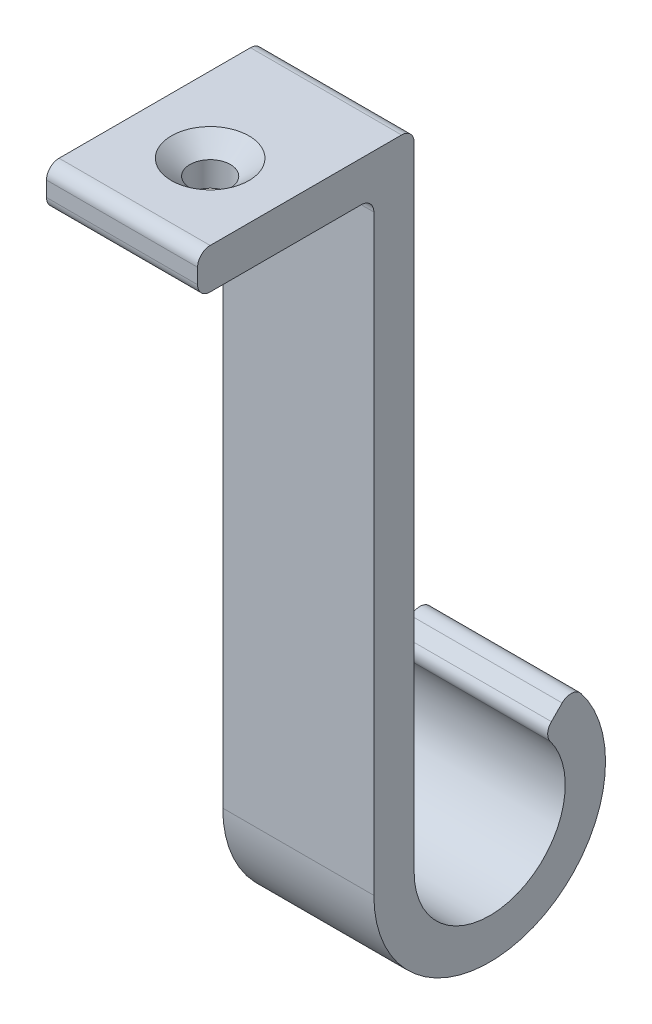
ISO-10303-21;
HEADER;
FILE_DESCRIPTION(('STEP AP214'),'2;1');
FILE_NAME('part.step','',(''),(''),'','','');
FILE_SCHEMA(('AUTOMOTIVE_DESIGN { 1 0 10303 214 1 1 1 1 }'));
ENDSEC;
DATA;
#1=APPLICATION_CONTEXT('core data for automotive mechanical design processes');
#2=APPLICATION_PROTOCOL_DEFINITION('international standard','automotive_design',2000,#1);
#3=PRODUCT_CONTEXT('',#1,'mechanical');
#4=PRODUCT('Part','Part','',(#3));
#5=PRODUCT_RELATED_PRODUCT_CATEGORY('part','',(#4));
#6=PRODUCT_DEFINITION_FORMATION('','',#4);
#7=PRODUCT_DEFINITION_CONTEXT('part definition',#1,'design');
#8=PRODUCT_DEFINITION('design','',#6,#7);
#9=PRODUCT_DEFINITION_SHAPE('','',#8);
#10=(LENGTH_UNIT() NAMED_UNIT(*) SI_UNIT(.MILLI.,.METRE.));
#11=(NAMED_UNIT(*) PLANE_ANGLE_UNIT() SI_UNIT($,.RADIAN.));
#12=(NAMED_UNIT(*) SI_UNIT($,.STERADIAN.) SOLID_ANGLE_UNIT());
#13=UNCERTAINTY_MEASURE_WITH_UNIT(LENGTH_MEASURE(1.E-05),#10,'distance_accuracy_value','');
#14=(GEOMETRIC_REPRESENTATION_CONTEXT(3) GLOBAL_UNCERTAINTY_ASSIGNED_CONTEXT((#13)) GLOBAL_UNIT_ASSIGNED_CONTEXT((#10,
#11,#12)) REPRESENTATION_CONTEXT('',''));
#15=CARTESIAN_POINT('',(0.,0.,0.));
#16=DIRECTION('',(0.,0.,1.));
#17=DIRECTION('',(1.,0.,0.));
#18=AXIS2_PLACEMENT_3D('',#15,#16,#17);
#19=CARTESIAN_POINT('',(9.525,-78.74,-13.6525));
#20=DIRECTION('',(0.,0.,1.));
#21=DIRECTION('',(0.,-1.,0.));
#22=AXIS2_PLACEMENT_3D('',#19,#20,#21);
#23=PLANE('',#22);
#24=DIRECTION('',(0.,1.,0.));
#25=VECTOR('',#24,1.);
#26=CARTESIAN_POINT('',(-9.525,-78.74,-13.6525));
#27=LINE('',#26,#25);
#28=CARTESIAN_POINT('',(-9.525,-78.74,-13.6525));
#29=VERTEX_POINT('',#28);
#30=CARTESIAN_POINT('',(-9.525,0.952500000000009,-13.6525));
#31=VERTEX_POINT('',#30);
#32=EDGE_CURVE('E192',#29,#31,#27,.T.);
#33=ORIENTED_EDGE('',*,*,#32,.T.);
#34=DIRECTION('',(-1.,0.,0.));
#35=VECTOR('',#34,1.);
#36=CARTESIAN_POINT('',(9.525,0.952500000000009,-13.6525));
#37=LINE('',#36,#35);
#38=CARTESIAN_POINT('',(9.525,0.952500000000009,-13.6525));
#39=VERTEX_POINT('',#38);
#40=EDGE_CURVE('E275',#31,#39,#37,.F.);
#41=ORIENTED_EDGE('',*,*,#40,.T.);
#42=DIRECTION('',(0.,1.,0.));
#43=VECTOR('',#42,1.);
#44=CARTESIAN_POINT('',(9.525,-78.74,-13.6525));
#45=LINE('',#44,#43);
#46=CARTESIAN_POINT('',(9.525,-78.74,-13.6525));
#47=VERTEX_POINT('',#46);
#48=EDGE_CURVE('E219',#47,#39,#45,.T.);
#49=ORIENTED_EDGE('',*,*,#48,.F.);
#50=DIRECTION('',(-1.,0.,0.));
#51=VECTOR('',#50,1.);
#52=CARTESIAN_POINT('',(9.525,-78.74,-13.6525));
#53=LINE('',#52,#51);
#54=EDGE_CURVE('E177',#47,#29,#53,.T.);
#55=ORIENTED_EDGE('',*,*,#54,.T.);
#56=EDGE_LOOP('',(#33,#41,#49,#55));
#57=FACE_BOUND('',#56,.T.);
#58=ADVANCED_FACE('F41',(#57),#23,.F.);
#59=CARTESIAN_POINT('',(9.525,2.54,13.6525));
#60=DIRECTION('',(0.,-1.,0.));
#61=DIRECTION('',(0.,0.,-1.));
#62=AXIS2_PLACEMENT_3D('',#59,#60,#61);
#63=PLANE('',#62);
#64=CARTESIAN_POINT('',(0.,2.54,2.54));
#65=DIRECTION('',(0.,1.,0.));
#66=DIRECTION('',(0.,0.,1.));
#67=AXIS2_PLACEMENT_3D('',#64,#65,#66);
#68=CIRCLE('',#67,4.8895);
#69=CARTESIAN_POINT('',(0.,2.54,7.4295));
#70=VERTEX_POINT('',#69);
#71=EDGE_CURVE('E358',#70,#70,#68,.T.);
#72=ORIENTED_EDGE('',*,*,#71,.F.);
#73=EDGE_LOOP('',(#72));
#74=FACE_BOUND('',#73,.T.);
#75=DIRECTION('',(0.,0.,1.));
#76=VECTOR('',#75,1.);
#77=CARTESIAN_POINT('',(-9.525,2.54,13.6525));
#78=LINE('',#77,#76);
#79=CARTESIAN_POINT('',(-9.525,2.54,-12.065));
#80=VERTEX_POINT('',#79);
#81=CARTESIAN_POINT('',(-9.525,2.54,12.065));
#82=VERTEX_POINT('',#81);
#83=EDGE_CURVE('E196',#80,#82,#78,.T.);
#84=ORIENTED_EDGE('',*,*,#83,.T.);
#85=DIRECTION('',(-1.,0.,0.));
#86=VECTOR('',#85,1.);
#87=CARTESIAN_POINT('',(9.525,2.54,12.065));
#88=LINE('',#87,#86);
#89=CARTESIAN_POINT('',(9.525,2.54,12.065));
#90=VERTEX_POINT('',#89);
#91=EDGE_CURVE('E248',#82,#90,#88,.F.);
#92=ORIENTED_EDGE('',*,*,#91,.T.);
#93=DIRECTION('',(0.,0.,1.));
#94=VECTOR('',#93,1.);
#95=CARTESIAN_POINT('',(9.525,2.54,13.6525));
#96=LINE('',#95,#94);
#97=CARTESIAN_POINT('',(9.525,2.54,-12.065));
#98=VERTEX_POINT('',#97);
#99=EDGE_CURVE('E342',#98,#90,#96,.T.);
#100=ORIENTED_EDGE('',*,*,#99,.F.);
#101=DIRECTION('',(-1.,0.,0.));
#102=VECTOR('',#101,1.);
#103=CARTESIAN_POINT('',(9.525,2.54,-12.065));
#104=LINE('',#103,#102);
#105=EDGE_CURVE('E244',#98,#80,#104,.T.);
#106=ORIENTED_EDGE('',*,*,#105,.T.);
#107=EDGE_LOOP('',(#84,#92,#100,#106));
#108=FACE_BOUND('',#107,.T.);
#109=ADVANCED_FACE('F317',(#74,#108),#63,.F.);
#110=CARTESIAN_POINT('',(9.525,-2.54,13.6525));
#111=DIRECTION('',(0.,0.,-1.));
#112=DIRECTION('',(-1.,0.,0.));
#113=AXIS2_PLACEMENT_3D('',#110,#111,#112);
#114=PLANE('',#113);
#115=DIRECTION('',(0.,-1.,0.));
#116=VECTOR('',#115,1.);
#117=CARTESIAN_POINT('',(9.525,-2.54,13.6525));
#118=LINE('',#117,#116);
#119=CARTESIAN_POINT('',(9.525,0.952500000000002,13.6525));
#120=VERTEX_POINT('',#119);
#121=CARTESIAN_POINT('',(9.525,-0.952500000000003,13.6525));
#122=VERTEX_POINT('',#121);
#123=EDGE_CURVE('E339',#120,#122,#118,.T.);
#124=ORIENTED_EDGE('',*,*,#123,.F.);
#125=DIRECTION('',(-1.,0.,0.));
#126=VECTOR('',#125,1.);
#127=CARTESIAN_POINT('',(9.525,0.952500000000003,13.6525));
#128=LINE('',#127,#126);
#129=CARTESIAN_POINT('',(-9.525,0.952500000000002,13.6525));
#130=VERTEX_POINT('',#129);
#131=EDGE_CURVE('E225',#120,#130,#128,.T.);
#132=ORIENTED_EDGE('',*,*,#131,.T.);
#133=DIRECTION('',(0.,-1.,0.));
#134=VECTOR('',#133,1.);
#135=CARTESIAN_POINT('',(-9.525,-2.54,13.6525));
#136=LINE('',#135,#134);
#137=CARTESIAN_POINT('',(-9.525,-0.952500000000003,13.6525));
#138=VERTEX_POINT('',#137);
#139=EDGE_CURVE('E200',#130,#138,#136,.T.);
#140=ORIENTED_EDGE('',*,*,#139,.T.);
#141=DIRECTION('',(-1.,0.,0.));
#142=VECTOR('',#141,1.);
#143=CARTESIAN_POINT('',(9.525,-0.952500000000002,13.6525));
#144=LINE('',#143,#142);
#145=EDGE_CURVE('E176',#138,#122,#144,.F.);
#146=ORIENTED_EDGE('',*,*,#145,.T.);
#147=EDGE_LOOP('',(#124,#132,#140,#146));
#148=FACE_BOUND('',#147,.T.);
#149=ADVANCED_FACE('F323',(#148),#114,.F.);
#150=CARTESIAN_POINT('',(9.525,-2.54,13.6525));
#151=DIRECTION('',(0.,1.,0.));
#152=DIRECTION('',(0.,0.,1.));
#153=AXIS2_PLACEMENT_3D('',#150,#151,#152);
#154=PLANE('',#153);
#155=CARTESIAN_POINT('',(0.,-2.54,2.54));
#156=DIRECTION('',(0.,1.,0.));
#157=DIRECTION('',(0.,0.,1.));
#158=AXIS2_PLACEMENT_3D('',#155,#156,#157);
#159=CIRCLE('',#158,2.55269999999999);
#160=CARTESIAN_POINT('',(0.,-2.54,5.09269999999999));
#161=VERTEX_POINT('',#160);
#162=EDGE_CURVE('E45',#161,#161,#159,.T.);
#163=ORIENTED_EDGE('',*,*,#162,.T.);
#164=EDGE_LOOP('',(#163));
#165=FACE_BOUND('',#164,.T.);
#166=DIRECTION('',(0.,0.,-1.));
#167=VECTOR('',#166,1.);
#168=CARTESIAN_POINT('',(9.525,-2.54,13.6525));
#169=LINE('',#168,#167);
#170=CARTESIAN_POINT('',(9.525,-2.54,12.065));
#171=VERTEX_POINT('',#170);
#172=CARTESIAN_POINT('',(9.525,-2.54,-6.985));
#173=VERTEX_POINT('',#172);
#174=EDGE_CURVE('E165',#171,#173,#169,.T.);
#175=ORIENTED_EDGE('',*,*,#174,.F.);
#176=DIRECTION('',(-1.,0.,0.));
#177=VECTOR('',#176,1.);
#178=CARTESIAN_POINT('',(9.525,-2.54,12.065));
#179=LINE('',#178,#177);
#180=CARTESIAN_POINT('',(-9.525,-2.54,12.065));
#181=VERTEX_POINT('',#180);
#182=EDGE_CURVE('E268',#171,#181,#179,.T.);
#183=ORIENTED_EDGE('',*,*,#182,.T.);
#184=DIRECTION('',(0.,0.,-1.));
#185=VECTOR('',#184,1.);
#186=CARTESIAN_POINT('',(-9.525,-2.54,13.6525));
#187=LINE('',#186,#185);
#188=CARTESIAN_POINT('',(-9.525,-2.54,-6.985));
#189=VERTEX_POINT('',#188);
#190=EDGE_CURVE('E204',#181,#189,#187,.T.);
#191=ORIENTED_EDGE('',*,*,#190,.T.);
#192=DIRECTION('',(-1.,0.,0.));
#193=VECTOR('',#192,1.);
#194=CARTESIAN_POINT('',(9.525,-2.54,-6.985));
#195=LINE('',#194,#193);
#196=EDGE_CURVE('E265',#189,#173,#195,.F.);
#197=ORIENTED_EDGE('',*,*,#196,.T.);
#198=EDGE_LOOP('',(#175,#183,#191,#197));
#199=FACE_BOUND('',#198,.T.);
#200=ADVANCED_FACE('F299',(#165,#199),#154,.F.);
#201=CARTESIAN_POINT('',(9.525,-78.74,-8.5725));
#202=DIRECTION('',(0.,0.,-1.));
#203=DIRECTION('',(0.,1.,0.));
#204=AXIS2_PLACEMENT_3D('',#201,#202,#203);
#205=PLANE('',#204);
#206=DIRECTION('',(0.,-1.,0.));
#207=VECTOR('',#206,1.);
#208=CARTESIAN_POINT('',(9.525,-78.74,-8.5725));
#209=LINE('',#208,#207);
#210=CARTESIAN_POINT('',(9.525,-4.12750000000003,-8.5725));
#211=VERTEX_POINT('',#210);
#212=CARTESIAN_POINT('',(9.525,-78.74,-8.5725));
#213=VERTEX_POINT('',#212);
#214=EDGE_CURVE('E152',#211,#213,#209,.T.);
#215=ORIENTED_EDGE('',*,*,#214,.F.);
#216=DIRECTION('',(-1.,0.,0.));
#217=VECTOR('',#216,1.);
#218=CARTESIAN_POINT('',(-9.525,-4.12750000000001,-8.5725));
#219=LINE('',#218,#217);
#220=CARTESIAN_POINT('',(-9.525,-4.12750000000003,-8.5725));
#221=VERTEX_POINT('',#220);
#222=EDGE_CURVE('E272',#211,#221,#219,.T.);
#223=ORIENTED_EDGE('',*,*,#222,.T.);
#224=DIRECTION('',(0.,-1.,0.));
#225=VECTOR('',#224,1.);
#226=CARTESIAN_POINT('',(-9.525,-78.74,-8.5725));
#227=LINE('',#226,#225);
#228=CARTESIAN_POINT('',(-9.525,-78.74,-8.5725));
#229=VERTEX_POINT('',#228);
#230=EDGE_CURVE('E171',#221,#229,#227,.T.);
#231=ORIENTED_EDGE('',*,*,#230,.T.);
#232=DIRECTION('',(-1.,0.,0.));
#233=VECTOR('',#232,1.);
#234=CARTESIAN_POINT('',(9.525,-78.74,-8.5725));
#235=LINE('',#234,#233);
#236=EDGE_CURVE('E168',#213,#229,#235,.T.);
#237=ORIENTED_EDGE('',*,*,#236,.F.);
#238=EDGE_LOOP('',(#215,#223,#231,#237));
#239=FACE_BOUND('',#238,.T.);
#240=ADVANCED_FACE('F169',(#239),#205,.F.);
#241=CARTESIAN_POINT('',(9.525,-78.74,-23.1775));
#242=DIRECTION('',(-1.,0.,0.));
#243=DIRECTION('',(0.,0.,1.));
#244=AXIS2_PLACEMENT_3D('',#241,#242,#243);
#245=CYLINDRICAL_SURFACE('',#244,14.605);
#246=CARTESIAN_POINT('',(-9.525,-78.74,-23.1775));
#247=DIRECTION('',(1.,0.,0.));
#248=DIRECTION('',(0.,0.,-1.));
#249=AXIS2_PLACEMENT_3D('',#246,#247,#248);
#250=CIRCLE('',#249,14.605);
#251=CARTESIAN_POINT('',(-9.525,-69.749213568494,-34.6871387581473));
#252=VERTEX_POINT('',#251);
#253=EDGE_CURVE('E210',#229,#252,#250,.T.);
#254=ORIENTED_EDGE('',*,*,#253,.T.);
#255=DIRECTION('',(-1.,0.,0.));
#256=VECTOR('',#255,1.);
#257=CARTESIAN_POINT('',(9.525,-69.749213568494,-34.6871387581473));
#258=LINE('',#257,#256);
#259=CARTESIAN_POINT('',(9.525,-69.749213568494,-34.6871387581473));
#260=VERTEX_POINT('',#259);
#261=EDGE_CURVE('E181',#252,#260,#258,.F.);
#262=ORIENTED_EDGE('',*,*,#261,.T.);
#263=CARTESIAN_POINT('',(9.525,-78.74,-23.1775));
#264=DIRECTION('',(1.,0.,0.));
#265=DIRECTION('',(0.,0.,-1.));
#266=AXIS2_PLACEMENT_3D('',#263,#264,#265);
#267=CIRCLE('',#266,14.605);
#268=EDGE_CURVE('E157',#213,#260,#267,.T.);
#269=ORIENTED_EDGE('',*,*,#268,.F.);
#270=ORIENTED_EDGE('',*,*,#236,.T.);
#271=EDGE_LOOP('',(#254,#262,#269,#270));
#272=FACE_BOUND('',#271,.T.);
#273=ADVANCED_FACE('F179',(#272),#245,.T.);
#274=CARTESIAN_POINT('',(9.525,-72.0048079091981,-29.9126920908019));
#275=DIRECTION('',(0.,-0.707106781186545,-0.70710678118655));
#276=DIRECTION('',(0.,0.70710678118655,-0.707106781186545));
#277=AXIS2_PLACEMENT_3D('',#274,#275,#276);
#278=PLANE('',#277);
#279=DIRECTION('',(0.,-0.70710678118655,0.707106781186545));
#280=VECTOR('',#279,1.);
#281=CARTESIAN_POINT('',(9.525,-72.0048079091981,-29.9126920908019));
#282=LINE('',#281,#280);
#283=CARTESIAN_POINT('',(9.525,-69.6039409480892,-32.3135590519107));
#284=VERTEX_POINT('',#283);
#285=CARTESIAN_POINT('',(9.525,-70.9628700666634,-30.9546299333366));
#286=VERTEX_POINT('',#285);
#287=EDGE_CURVE('E183',#284,#286,#282,.T.);
#288=ORIENTED_EDGE('',*,*,#287,.F.);
#289=DIRECTION('',(-1.,0.,0.));
#290=VECTOR('',#289,1.);
#291=CARTESIAN_POINT('',(9.525,-69.6039409480892,-32.3135590519107));
#292=LINE('',#291,#290);
#293=CARTESIAN_POINT('',(-9.525,-69.6039409480892,-32.3135590519107));
#294=VERTEX_POINT('',#293);
#295=EDGE_CURVE('E280',#284,#294,#292,.T.);
#296=ORIENTED_EDGE('',*,*,#295,.T.);
#297=DIRECTION('',(0.,-0.70710678118655,0.707106781186545));
#298=VECTOR('',#297,1.);
#299=CARTESIAN_POINT('',(-9.525,-72.0048079091981,-29.9126920908019));
#300=LINE('',#299,#298);
#301=CARTESIAN_POINT('',(-9.525,-70.9628700666634,-30.9546299333366));
#302=VERTEX_POINT('',#301);
#303=EDGE_CURVE('E213',#294,#302,#300,.T.);
#304=ORIENTED_EDGE('',*,*,#303,.T.);
#305=DIRECTION('',(-1.,0.,0.));
#306=VECTOR('',#305,1.);
#307=CARTESIAN_POINT('',(9.525,-70.9628700666634,-30.9546299333366));
#308=LINE('',#307,#306);
#309=EDGE_CURVE('E66',#302,#286,#308,.F.);
#310=ORIENTED_EDGE('',*,*,#309,.T.);
#311=EDGE_LOOP('',(#288,#296,#304,#310));
#312=FACE_BOUND('',#311,.T.);
#313=ADVANCED_FACE('F378',(#312),#278,.F.);
#314=CARTESIAN_POINT('',(9.525,-78.74,-23.1775));
#315=DIRECTION('',(-1.,0.,0.));
#316=DIRECTION('',(0.,0.,1.));
#317=AXIS2_PLACEMENT_3D('',#314,#315,#316);
#318=CYLINDRICAL_SURFACE('',#317,9.525);
#319=CARTESIAN_POINT('',(9.525,-78.74,-23.1775));
#320=DIRECTION('',(-1.,0.,0.));
#321=DIRECTION('',(0.,0.,-1.));
#322=AXIS2_PLACEMENT_3D('',#319,#320,#321);
#323=CIRCLE('',#322,9.525);
#324=CARTESIAN_POINT('',(9.525,-73.0360589272546,-30.8057816701173));
#325=VERTEX_POINT('',#324);
#326=EDGE_CURVE('E186',#325,#47,#323,.T.);
#327=ORIENTED_EDGE('',*,*,#326,.F.);
#328=DIRECTION('',(-1.,0.,0.));
#329=VECTOR('',#328,1.);
#330=CARTESIAN_POINT('',(9.525,-73.0360589272546,-30.8057816701173));
#331=LINE('',#330,#329);
#332=CARTESIAN_POINT('',(-9.525,-73.0360589272546,-30.8057816701173));
#333=VERTEX_POINT('',#332);
#334=EDGE_CURVE('E286',#325,#333,#331,.T.);
#335=ORIENTED_EDGE('',*,*,#334,.T.);
#336=CARTESIAN_POINT('',(-9.525,-78.74,-23.1775));
#337=DIRECTION('',(-1.,0.,0.));
#338=DIRECTION('',(0.,0.,-1.));
#339=AXIS2_PLACEMENT_3D('',#336,#337,#338);
#340=CIRCLE('',#339,9.525);
#341=EDGE_CURVE('E216',#333,#29,#340,.T.);
#342=ORIENTED_EDGE('',*,*,#341,.T.);
#343=ORIENTED_EDGE('',*,*,#54,.F.);
#344=EDGE_LOOP('',(#327,#335,#342,#343));
#345=FACE_BOUND('',#344,.T.);
#346=ADVANCED_FACE('F375',(#345),#318,.F.);
#347=CARTESIAN_POINT('',(9.525,-78.74,-23.1775));
#348=DIRECTION('',(1.,0.,0.));
#349=DIRECTION('',(0.,0.,-1.));
#350=AXIS2_PLACEMENT_3D('',#347,#348,#349);
#351=PLANE('',#350);
#352=ORIENTED_EDGE('',*,*,#99,.T.);
#353=CARTESIAN_POINT('',(9.525,0.952500000000003,12.065));
#354=DIRECTION('',(1.,0.,0.));
#355=DIRECTION('',(0.,0.,-1.));
#356=AXIS2_PLACEMENT_3D('',#353,#354,#355);
#357=CIRCLE('',#356,1.5875);
#358=EDGE_CURVE('E262',#90,#120,#357,.T.);
#359=ORIENTED_EDGE('',*,*,#358,.T.);
#360=ORIENTED_EDGE('',*,*,#123,.T.);
#361=CARTESIAN_POINT('',(9.525,-0.952500000000002,12.065));
#362=DIRECTION('',(1.,0.,0.));
#363=DIRECTION('',(0.,0.,-1.));
#364=AXIS2_PLACEMENT_3D('',#361,#362,#363);
#365=CIRCLE('',#364,1.5875);
#366=EDGE_CURVE('E259',#122,#171,#365,.T.);
#367=ORIENTED_EDGE('',*,*,#366,.T.);
#368=ORIENTED_EDGE('',*,*,#174,.T.);
#369=CARTESIAN_POINT('',(9.525,-4.12750000000001,-6.985));
#370=DIRECTION('',(1.,0.,0.));
#371=DIRECTION('',(0.,0.,-1.));
#372=AXIS2_PLACEMENT_3D('',#369,#370,#371);
#373=CIRCLE('',#372,1.5875);
#374=EDGE_CURVE('E11',#173,#211,#373,.F.);
#375=ORIENTED_EDGE('',*,*,#374,.T.);
#376=ORIENTED_EDGE('',*,*,#214,.T.);
#377=ORIENTED_EDGE('',*,*,#268,.T.);
#378=CARTESIAN_POINT('',(9.525,-70.7264729632229,-33.4360910670444));
#379=DIRECTION('',(1.,0.,0.));
#380=DIRECTION('',(0.,0.,-1.));
#381=AXIS2_PLACEMENT_3D('',#378,#379,#380);
#382=CIRCLE('',#381,1.5875);
#383=EDGE_CURVE('E253',#260,#284,#382,.T.);
#384=ORIENTED_EDGE('',*,*,#383,.T.);
#385=ORIENTED_EDGE('',*,*,#287,.T.);
#386=CARTESIAN_POINT('',(9.525,-72.085402081797,-32.0771619484702));
#387=DIRECTION('',(1.,0.,0.));
#388=DIRECTION('',(0.,0.,-1.));
#389=AXIS2_PLACEMENT_3D('',#386,#387,#388);
#390=CIRCLE('',#389,1.5875);
#391=EDGE_CURVE('E58',#286,#325,#390,.T.);
#392=ORIENTED_EDGE('',*,*,#391,.T.);
#393=ORIENTED_EDGE('',*,*,#326,.T.);
#394=ORIENTED_EDGE('',*,*,#48,.T.);
#395=CARTESIAN_POINT('',(9.525,0.952500000000003,-12.065));
#396=DIRECTION('',(1.,0.,0.));
#397=DIRECTION('',(0.,0.,-1.));
#398=AXIS2_PLACEMENT_3D('',#395,#396,#397);
#399=CIRCLE('',#398,1.5875);
#400=EDGE_CURVE('E256',#39,#98,#399,.T.);
#401=ORIENTED_EDGE('',*,*,#400,.T.);
#402=EDGE_LOOP('',(#352,#359,#360,#367,#368,#375,#376,#377,#384,#385,#392,#393,#394,#401));
#403=FACE_BOUND('',#402,.T.);
#404=ADVANCED_FACE('F155',(#403),#351,.T.);
#405=CARTESIAN_POINT('',(-9.525,-78.74,-23.1775));
#406=DIRECTION('',(1.,0.,0.));
#407=DIRECTION('',(0.,0.,-1.));
#408=AXIS2_PLACEMENT_3D('',#405,#406,#407);
#409=PLANE('',#408);
#410=ORIENTED_EDGE('',*,*,#139,.F.);
#411=CARTESIAN_POINT('',(-9.525,0.952500000000003,12.065));
#412=DIRECTION('',(1.,0.,0.));
#413=DIRECTION('',(0.,0.,-1.));
#414=AXIS2_PLACEMENT_3D('',#411,#412,#413);
#415=CIRCLE('',#414,1.5875);
#416=EDGE_CURVE('E241',#130,#82,#415,.F.);
#417=ORIENTED_EDGE('',*,*,#416,.T.);
#418=ORIENTED_EDGE('',*,*,#83,.F.);
#419=CARTESIAN_POINT('',(-9.525,0.952500000000003,-12.065));
#420=DIRECTION('',(1.,0.,0.));
#421=DIRECTION('',(0.,0.,-1.));
#422=AXIS2_PLACEMENT_3D('',#419,#420,#421);
#423=CIRCLE('',#422,1.5875);
#424=EDGE_CURVE('E235',#80,#31,#423,.F.);
#425=ORIENTED_EDGE('',*,*,#424,.T.);
#426=ORIENTED_EDGE('',*,*,#32,.F.);
#427=ORIENTED_EDGE('',*,*,#341,.F.);
#428=CARTESIAN_POINT('',(-9.525,-72.085402081797,-32.0771619484702));
#429=DIRECTION('',(1.,0.,0.));
#430=DIRECTION('',(0.,0.,-1.));
#431=AXIS2_PLACEMENT_3D('',#428,#429,#430);
#432=CIRCLE('',#431,1.5875);
#433=EDGE_CURVE('E229',#333,#302,#432,.F.);
#434=ORIENTED_EDGE('',*,*,#433,.T.);
#435=ORIENTED_EDGE('',*,*,#303,.F.);
#436=CARTESIAN_POINT('',(-9.525,-70.7264729632229,-33.4360910670444));
#437=DIRECTION('',(1.,0.,0.));
#438=DIRECTION('',(0.,0.,-1.));
#439=AXIS2_PLACEMENT_3D('',#436,#437,#438);
#440=CIRCLE('',#439,1.5875);
#441=EDGE_CURVE('E232',#294,#252,#440,.F.);
#442=ORIENTED_EDGE('',*,*,#441,.T.);
#443=ORIENTED_EDGE('',*,*,#253,.F.);
#444=ORIENTED_EDGE('',*,*,#230,.F.);
#445=CARTESIAN_POINT('',(-9.525,-4.12750000000001,-6.985));
#446=DIRECTION('',(1.,0.,0.));
#447=DIRECTION('',(0.,0.,-1.));
#448=AXIS2_PLACEMENT_3D('',#445,#446,#447);
#449=CIRCLE('',#448,1.5875);
#450=EDGE_CURVE('E51',#221,#189,#449,.T.);
#451=ORIENTED_EDGE('',*,*,#450,.T.);
#452=ORIENTED_EDGE('',*,*,#190,.F.);
#453=CARTESIAN_POINT('',(-9.525,-0.952500000000002,12.065));
#454=DIRECTION('',(1.,0.,0.));
#455=DIRECTION('',(0.,0.,-1.));
#456=AXIS2_PLACEMENT_3D('',#453,#454,#455);
#457=CIRCLE('',#456,1.5875);
#458=EDGE_CURVE('E238',#181,#138,#457,.F.);
#459=ORIENTED_EDGE('',*,*,#458,.T.);
#460=EDGE_LOOP('',(#410,#417,#418,#425,#426,#427,#434,#435,#442,#443,#444,#451,#452,#459));
#461=FACE_BOUND('',#460,.T.);
#462=ADVANCED_FACE('F294',(#461),#409,.F.);
#463=CARTESIAN_POINT('',(9.525,0.952500000000003,12.065));
#464=DIRECTION('',(-1.,0.,0.));
#465=DIRECTION('',(0.,0.,1.));
#466=AXIS2_PLACEMENT_3D('',#463,#464,#465);
#467=CYLINDRICAL_SURFACE('',#466,1.5875);
#468=ORIENTED_EDGE('',*,*,#358,.F.);
#469=ORIENTED_EDGE('',*,*,#91,.F.);
#470=ORIENTED_EDGE('',*,*,#416,.F.);
#471=ORIENTED_EDGE('',*,*,#131,.F.);
#472=EDGE_LOOP('',(#468,#469,#470,#471));
#473=FACE_BOUND('',#472,.T.);
#474=ADVANCED_FACE('F313',(#473),#467,.T.);
#475=CARTESIAN_POINT('',(9.525,-0.952500000000002,12.065));
#476=DIRECTION('',(-1.,0.,0.));
#477=DIRECTION('',(0.,0.,1.));
#478=AXIS2_PLACEMENT_3D('',#475,#476,#477);
#479=CYLINDRICAL_SURFACE('',#478,1.5875);
#480=ORIENTED_EDGE('',*,*,#366,.F.);
#481=ORIENTED_EDGE('',*,*,#145,.F.);
#482=ORIENTED_EDGE('',*,*,#458,.F.);
#483=ORIENTED_EDGE('',*,*,#182,.F.);
#484=EDGE_LOOP('',(#480,#481,#482,#483));
#485=FACE_BOUND('',#484,.T.);
#486=ADVANCED_FACE('F304',(#485),#479,.T.);
#487=CARTESIAN_POINT('',(9.525,-4.12750000000001,-6.985));
#488=DIRECTION('',(1.,0.,0.));
#489=DIRECTION('',(0.,0.,-1.));
#490=AXIS2_PLACEMENT_3D('',#487,#488,#489);
#491=CYLINDRICAL_SURFACE('',#490,1.5875);
#492=ORIENTED_EDGE('',*,*,#374,.F.);
#493=ORIENTED_EDGE('',*,*,#196,.F.);
#494=ORIENTED_EDGE('',*,*,#450,.F.);
#495=ORIENTED_EDGE('',*,*,#222,.F.);
#496=EDGE_LOOP('',(#492,#493,#494,#495));
#497=FACE_BOUND('',#496,.T.);
#498=ADVANCED_FACE('F301',(#497),#491,.F.);
#499=CARTESIAN_POINT('',(9.525,0.952500000000003,-12.065));
#500=DIRECTION('',(-1.,0.,0.));
#501=DIRECTION('',(0.,0.,1.));
#502=AXIS2_PLACEMENT_3D('',#499,#500,#501);
#503=CYLINDRICAL_SURFACE('',#502,1.5875);
#504=ORIENTED_EDGE('',*,*,#400,.F.);
#505=ORIENTED_EDGE('',*,*,#40,.F.);
#506=ORIENTED_EDGE('',*,*,#424,.F.);
#507=ORIENTED_EDGE('',*,*,#105,.F.);
#508=EDGE_LOOP('',(#504,#505,#506,#507));
#509=FACE_BOUND('',#508,.T.);
#510=ADVANCED_FACE('F303',(#509),#503,.T.);
#511=CARTESIAN_POINT('',(9.525,-70.7264729632229,-33.4360910670444));
#512=DIRECTION('',(-1.,0.,0.));
#513=DIRECTION('',(0.,0.,1.));
#514=AXIS2_PLACEMENT_3D('',#511,#512,#513);
#515=CYLINDRICAL_SURFACE('',#514,1.5875);
#516=ORIENTED_EDGE('',*,*,#383,.F.);
#517=ORIENTED_EDGE('',*,*,#261,.F.);
#518=ORIENTED_EDGE('',*,*,#441,.F.);
#519=ORIENTED_EDGE('',*,*,#295,.F.);
#520=EDGE_LOOP('',(#516,#517,#518,#519));
#521=FACE_BOUND('',#520,.T.);
#522=ADVANCED_FACE('F310',(#521),#515,.T.);
#523=CARTESIAN_POINT('',(9.525,-72.085402081797,-32.0771619484702));
#524=DIRECTION('',(-1.,0.,0.));
#525=DIRECTION('',(0.,0.,1.));
#526=AXIS2_PLACEMENT_3D('',#523,#524,#525);
#527=CYLINDRICAL_SURFACE('',#526,1.5875);
#528=ORIENTED_EDGE('',*,*,#391,.F.);
#529=ORIENTED_EDGE('',*,*,#309,.F.);
#530=ORIENTED_EDGE('',*,*,#433,.F.);
#531=ORIENTED_EDGE('',*,*,#334,.F.);
#532=EDGE_LOOP('',(#528,#529,#530,#531));
#533=FACE_BOUND('',#532,.T.);
#534=ADVANCED_FACE('F43',(#533),#527,.T.);
#535=CARTESIAN_POINT('',(0.,2.54,2.54));
#536=DIRECTION('',(0.,1.,0.));
#537=DIRECTION('',(0.,0.,1.));
#538=AXIS2_PLACEMENT_3D('',#535,#536,#537);
#539=CYLINDRICAL_SURFACE('',#538,2.55269999999999);
#540=CARTESIAN_POINT('',(0.,0.579191981864932,2.54));
#541=DIRECTION('',(0.,1.,0.));
#542=DIRECTION('',(0.,0.,1.));
#543=AXIS2_PLACEMENT_3D('',#540,#541,#542);
#544=CIRCLE('',#543,2.5527);
#545=CARTESIAN_POINT('',(0.,0.579191981864932,5.0927));
#546=VERTEX_POINT('',#545);
#547=EDGE_CURVE('E354',#546,#546,#544,.T.);
#548=ORIENTED_EDGE('',*,*,#547,.T.);
#549=EDGE_LOOP('',(#548));
#550=FACE_BOUND('',#549,.T.);
#551=ORIENTED_EDGE('',*,*,#162,.F.);
#552=EDGE_LOOP('',(#551));
#553=FACE_BOUND('',#552,.T.);
#554=ADVANCED_FACE('F381',(#550,#553),#539,.F.);
#555=CARTESIAN_POINT('',(0.,2.54,2.54));
#556=DIRECTION('',(0.,1.,0.));
#557=DIRECTION('',(0.,0.,1.));
#558=AXIS2_PLACEMENT_3D('',#555,#556,#557);
#559=CONICAL_SURFACE('',#558,4.8895,0.872664625997164);
#560=ORIENTED_EDGE('',*,*,#547,.F.);
#561=EDGE_LOOP('',(#560));
#562=FACE_BOUND('',#561,.T.);
#563=ORIENTED_EDGE('',*,*,#71,.T.);
#564=EDGE_LOOP('',(#563));
#565=FACE_BOUND('',#564,.T.);
#566=ADVANCED_FACE('F363',(#562,#565),#559,.F.);
#567=CLOSED_SHELL('',(#58,#109,#149,#200,#240,#273,#313,#346,#404,#462,#474,#486,#498,#510,#522,
#534,#554,#566));
#568=MANIFOLD_SOLID_BREP('B2',#567);
#569=ADVANCED_BREP_SHAPE_REPRESENTATION('',(#18,#568),#14);
#570=SHAPE_DEFINITION_REPRESENTATION(#9,#569);
ENDSEC;
END-ISO-10303-21;
